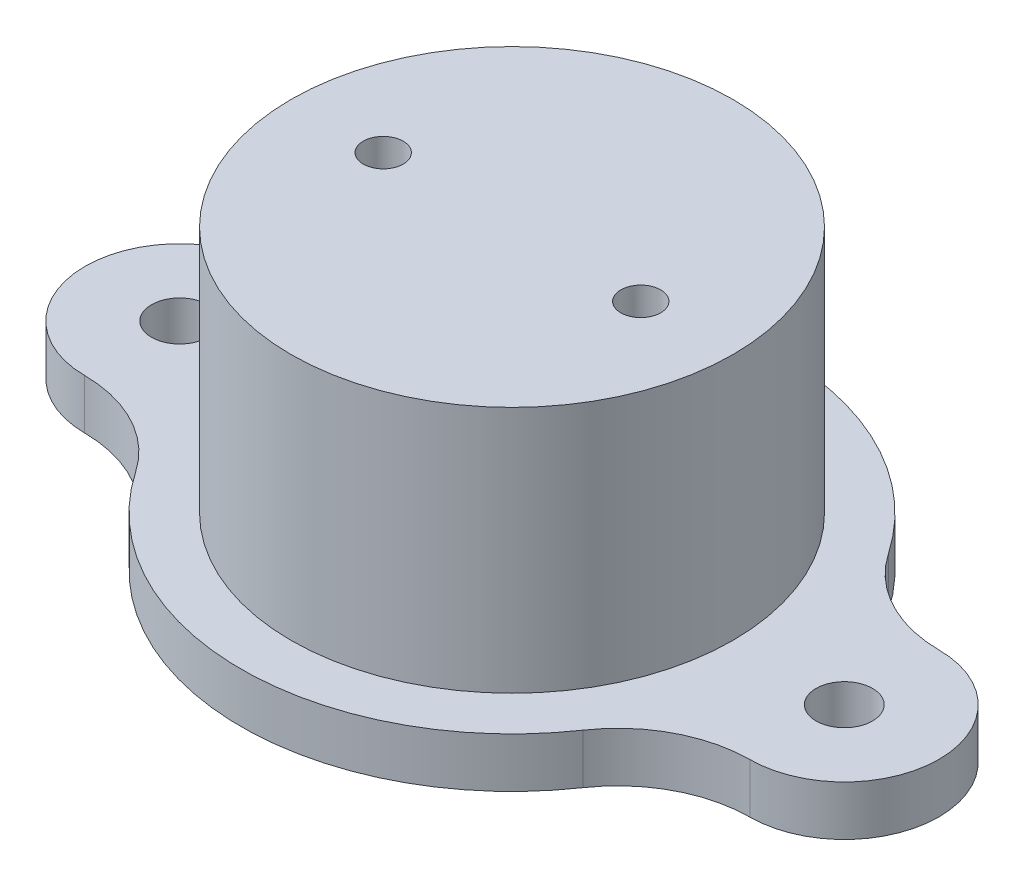
ISO-10303-21;
HEADER;
FILE_DESCRIPTION(('STEP AP214'),'2;1');
FILE_NAME('part.step','',(''),(''),'','','');
FILE_SCHEMA(('AUTOMOTIVE_DESIGN { 1 0 10303 214 1 1 1 1 }'));
ENDSEC;
DATA;
#1=APPLICATION_CONTEXT('core data for automotive mechanical design processes');
#2=APPLICATION_PROTOCOL_DEFINITION('international standard','automotive_design',2000,#1);
#3=PRODUCT_CONTEXT('',#1,'mechanical');
#4=PRODUCT('Part','Part','',(#3));
#5=PRODUCT_RELATED_PRODUCT_CATEGORY('part','',(#4));
#6=PRODUCT_DEFINITION_FORMATION('','',#4);
#7=PRODUCT_DEFINITION_CONTEXT('part definition',#1,'design');
#8=PRODUCT_DEFINITION('design','',#6,#7);
#9=PRODUCT_DEFINITION_SHAPE('','',#8);
#10=(LENGTH_UNIT() NAMED_UNIT(*) SI_UNIT(.MILLI.,.METRE.));
#11=(NAMED_UNIT(*) PLANE_ANGLE_UNIT() SI_UNIT($,.RADIAN.));
#12=(NAMED_UNIT(*) SI_UNIT($,.STERADIAN.) SOLID_ANGLE_UNIT());
#13=UNCERTAINTY_MEASURE_WITH_UNIT(LENGTH_MEASURE(1.E-05),#10,'distance_accuracy_value','');
#14=(GEOMETRIC_REPRESENTATION_CONTEXT(3) GLOBAL_UNCERTAINTY_ASSIGNED_CONTEXT((#13)) GLOBAL_UNIT_ASSIGNED_CONTEXT((#10,
#11,#12)) REPRESENTATION_CONTEXT('',''));
#15=CARTESIAN_POINT('',(0.,0.,0.));
#16=DIRECTION('',(0.,0.,1.));
#17=DIRECTION('',(1.,0.,0.));
#18=AXIS2_PLACEMENT_3D('',#15,#16,#17);
#19=CARTESIAN_POINT('',(0.,0.,0.));
#20=DIRECTION('',(0.,1.,0.));
#21=DIRECTION('',(-1.,0.,0.));
#22=AXIS2_PLACEMENT_3D('',#19,#20,#21);
#23=PLANE('',#22);
#24=CARTESIAN_POINT('',(-7.75,0.,0.));
#25=DIRECTION('',(0.,1.,0.));
#26=DIRECTION('',(0.,0.,1.));
#27=AXIS2_PLACEMENT_3D('',#24,#25,#26);
#28=CIRCLE('',#27,1.2);
#29=CARTESIAN_POINT('',(-7.75,0.,1.2));
#30=VERTEX_POINT('',#29);
#31=EDGE_CURVE('E246',#30,#30,#28,.F.);
#32=ORIENTED_EDGE('',*,*,#31,.F.);
#33=EDGE_LOOP('',(#32));
#34=FACE_BOUND('',#33,.T.);
#35=CARTESIAN_POINT('',(0.,0.,0.));
#36=DIRECTION('',(0.,-1.,0.));
#37=DIRECTION('',(1.,0.,0.));
#38=AXIS2_PLACEMENT_3D('',#35,#36,#37);
#39=CIRCLE('',#38,11.7);
#40=CARTESIAN_POINT('',(11.7,0.,0.));
#41=VERTEX_POINT('',#40);
#42=EDGE_CURVE('E11',#41,#41,#39,.T.);
#43=ORIENTED_EDGE('',*,*,#42,.T.);
#44=EDGE_LOOP('',(#43));
#45=FACE_BOUND('',#44,.T.);
#46=CARTESIAN_POINT('',(7.75,0.,0.));
#47=DIRECTION('',(0.,1.,0.));
#48=DIRECTION('',(0.,0.,1.));
#49=AXIS2_PLACEMENT_3D('',#46,#47,#48);
#50=CIRCLE('',#49,1.2);
#51=CARTESIAN_POINT('',(7.75,0.,1.2));
#52=VERTEX_POINT('',#51);
#53=EDGE_CURVE('E251',#52,#52,#50,.T.);
#54=ORIENTED_EDGE('',*,*,#53,.T.);
#55=EDGE_LOOP('',(#54));
#56=FACE_BOUND('',#55,.T.);
#57=ADVANCED_FACE('F34',(#34,#45,#56),#23,.F.);
#58=CARTESIAN_POINT('',(0.,2.99999999999998,0.));
#59=DIRECTION('',(0.,-1.,0.));
#60=DIRECTION('',(1.,0.,0.));
#61=AXIS2_PLACEMENT_3D('',#58,#59,#60);
#62=PLANE('',#61);
#63=CARTESIAN_POINT('',(-7.75,2.99999999999995,0.));
#64=DIRECTION('',(0.,-1.,0.));
#65=DIRECTION('',(1.,0.,0.));
#66=AXIS2_PLACEMENT_3D('',#63,#64,#65);
#67=CIRCLE('',#66,1.2);
#68=CARTESIAN_POINT('',(-6.55,2.99999999999995,0.));
#69=VERTEX_POINT('',#68);
#70=EDGE_CURVE('E257',#69,#69,#67,.F.);
#71=ORIENTED_EDGE('',*,*,#70,.F.);
#72=EDGE_LOOP('',(#71));
#73=FACE_BOUND('',#72,.T.);
#74=CARTESIAN_POINT('',(0.,2.99999999999995,0.));
#75=DIRECTION('',(0.,-1.,0.));
#76=DIRECTION('',(1.,0.,0.));
#77=AXIS2_PLACEMENT_3D('',#74,#75,#76);
#78=CIRCLE('',#77,13.3);
#79=CARTESIAN_POINT('',(13.3,2.99999999999999,0.));
#80=VERTEX_POINT('',#79);
#81=EDGE_CURVE('E168',#80,#80,#78,.T.);
#82=ORIENTED_EDGE('',*,*,#81,.F.);
#83=EDGE_LOOP('',(#82));
#84=FACE_BOUND('',#83,.T.);
#85=CARTESIAN_POINT('',(7.75,3.,0.));
#86=DIRECTION('',(0.,-1.,0.));
#87=DIRECTION('',(1.,0.,0.));
#88=AXIS2_PLACEMENT_3D('',#85,#86,#87);
#89=CIRCLE('',#88,1.2);
#90=CARTESIAN_POINT('',(8.95,3.00000000000001,0.));
#91=VERTEX_POINT('',#90);
#92=EDGE_CURVE('E253',#91,#91,#89,.T.);
#93=ORIENTED_EDGE('',*,*,#92,.T.);
#94=EDGE_LOOP('',(#93));
#95=FACE_BOUND('',#94,.T.);
#96=ADVANCED_FACE('F234',(#73,#84,#95),#62,.F.);
#97=CARTESIAN_POINT('',(9.50813650303509E-13,-272.323852837361,0.));
#98=DIRECTION('',(0.,-1.,0.));
#99=DIRECTION('',(1.,0.,0.));
#100=AXIS2_PLACEMENT_3D('',#97,#98,#99);
#101=CYLINDRICAL_SURFACE('',#100,16.3);
#102=DIRECTION('',(0.,1.,0.));
#103=VECTOR('',#102,1.);
#104=CARTESIAN_POINT('',(13.4625925925926,-14.9,-9.18959197602761));
#105=LINE('',#104,#103);
#106=CARTESIAN_POINT('',(13.4625925925926,-14.9,-9.18959197602759));
#107=VERTEX_POINT('',#106);
#108=CARTESIAN_POINT('',(13.4625925925926,-11.9,-9.1895919760276));
#109=VERTEX_POINT('',#108);
#110=EDGE_CURVE('E56',#107,#109,#105,.T.);
#111=ORIENTED_EDGE('',*,*,#110,.F.);
#112=CARTESIAN_POINT('',(0.,-14.9000000000001,0.));
#113=DIRECTION('',(0.,-1.,0.));
#114=DIRECTION('',(1.,0.,0.));
#115=AXIS2_PLACEMENT_3D('',#112,#113,#114);
#116=CIRCLE('',#115,16.3);
#117=CARTESIAN_POINT('',(-13.4625925925925,-14.9000000000001,-9.18959197602759));
#118=VERTEX_POINT('',#117);
#119=EDGE_CURVE('E188',#118,#107,#116,.T.);
#120=ORIENTED_EDGE('',*,*,#119,.F.);
#121=DIRECTION('',(0.,1.,0.));
#122=VECTOR('',#121,1.);
#123=CARTESIAN_POINT('',(-13.4625925925925,-14.9000000000001,-9.18959197602761));
#124=LINE('',#123,#122);
#125=CARTESIAN_POINT('',(-13.4625925925925,-11.9000000000001,-9.18959197602761));
#126=VERTEX_POINT('',#125);
#127=EDGE_CURVE('E171',#118,#126,#124,.T.);
#128=ORIENTED_EDGE('',*,*,#127,.T.);
#129=CARTESIAN_POINT('',(0.,-11.9000000000001,0.));
#130=DIRECTION('',(0.,-1.,0.));
#131=DIRECTION('',(1.,0.,0.));
#132=AXIS2_PLACEMENT_3D('',#129,#130,#131);
#133=CIRCLE('',#132,16.3);
#134=EDGE_CURVE('E182',#126,#109,#133,.T.);
#135=ORIENTED_EDGE('',*,*,#134,.T.);
#136=EDGE_LOOP('',(#111,#120,#128,#135));
#137=FACE_BOUND('',#136,.T.);
#138=ADVANCED_FACE('F223',(#137),#101,.T.);
#139=CARTESIAN_POINT('',(13.4625925925926,-14.9,9.18959197602759));
#140=VERTEX_POINT('',#139);
#141=CARTESIAN_POINT('',(-13.4625925925925,-14.9000000000001,9.18959197602759));
#142=VERTEX_POINT('',#141);
#143=EDGE_CURVE('E48',#140,#142,#116,.T.);
#144=ORIENTED_EDGE('',*,*,#143,.F.);
#145=DIRECTION('',(0.,1.,0.));
#146=VECTOR('',#145,1.);
#147=CARTESIAN_POINT('',(13.4625925925926,-14.9,9.18959197602761));
#148=LINE('',#147,#146);
#149=CARTESIAN_POINT('',(13.4625925925926,-11.9,9.18959197602761));
#150=VERTEX_POINT('',#149);
#151=EDGE_CURVE('E123',#140,#150,#148,.T.);
#152=ORIENTED_EDGE('',*,*,#151,.T.);
#153=CARTESIAN_POINT('',(-13.4625925925925,-11.9000000000001,9.1895919760276));
#154=VERTEX_POINT('',#153);
#155=EDGE_CURVE('E181',#150,#154,#133,.T.);
#156=ORIENTED_EDGE('',*,*,#155,.T.);
#157=DIRECTION('',(0.,1.,0.));
#158=VECTOR('',#157,1.);
#159=CARTESIAN_POINT('',(-13.4625925925925,-14.9000000000001,9.18959197602761));
#160=LINE('',#159,#158);
#161=EDGE_CURVE('E158',#142,#154,#160,.T.);
#162=ORIENTED_EDGE('',*,*,#161,.F.);
#163=EDGE_LOOP('',(#144,#152,#156,#162));
#164=FACE_BOUND('',#163,.T.);
#165=ADVANCED_FACE('F226',(#164),#101,.T.);
#166=CARTESIAN_POINT('',(9.50813650303509E-13,-272.323852837361,0.));
#167=DIRECTION('',(0.,-1.,0.));
#168=DIRECTION('',(1.,0.,0.));
#169=AXIS2_PLACEMENT_3D('',#166,#167,#168);
#170=CYLINDRICAL_SURFACE('',#169,11.7);
#171=ORIENTED_EDGE('',*,*,#42,.F.);
#172=EDGE_LOOP('',(#171));
#173=FACE_BOUND('',#172,.T.);
#174=CARTESIAN_POINT('',(0.,-16.0000000000001,0.));
#175=DIRECTION('',(0.,-1.,0.));
#176=DIRECTION('',(1.,0.,0.));
#177=AXIS2_PLACEMENT_3D('',#174,#175,#176);
#178=CIRCLE('',#177,11.6999999999999);
#179=CARTESIAN_POINT('',(11.7,-16.,0.));
#180=VERTEX_POINT('',#179);
#181=EDGE_CURVE('E41',#180,#180,#178,.T.);
#182=ORIENTED_EDGE('',*,*,#181,.T.);
#183=EDGE_LOOP('',(#182));
#184=FACE_BOUND('',#183,.T.);
#185=ADVANCED_FACE('F193',(#173,#184),#170,.F.);
#186=CARTESIAN_POINT('',(0.,-16.,0.));
#187=DIRECTION('',(0.,1.,0.));
#188=DIRECTION('',(-1.,0.,0.));
#189=AXIS2_PLACEMENT_3D('',#186,#187,#188);
#190=PLANE('',#189);
#191=ORIENTED_EDGE('',*,*,#181,.F.);
#192=EDGE_LOOP('',(#191));
#193=FACE_BOUND('',#192,.T.);
#194=CARTESIAN_POINT('',(0.,-16.0000000000001,0.));
#195=DIRECTION('',(0.,-1.,0.));
#196=DIRECTION('',(1.,0.,0.));
#197=AXIS2_PLACEMENT_3D('',#194,#195,#196);
#198=CIRCLE('',#197,13.2999999999999);
#199=CARTESIAN_POINT('',(13.3,-16.,0.));
#200=VERTEX_POINT('',#199);
#201=EDGE_CURVE('E187',#200,#200,#198,.T.);
#202=ORIENTED_EDGE('',*,*,#201,.T.);
#203=EDGE_LOOP('',(#202));
#204=FACE_BOUND('',#203,.T.);
#205=ADVANCED_FACE('F195',(#193,#204),#190,.F.);
#206=CARTESIAN_POINT('',(0.,-14.9000000000001,0.));
#207=DIRECTION('',(0.,1.,0.));
#208=DIRECTION('',(-1.,0.,0.));
#209=AXIS2_PLACEMENT_3D('',#206,#207,#208);
#210=CONICAL_SURFACE('',#209,16.3,1.21935153279135);
#211=ORIENTED_EDGE('',*,*,#201,.F.);
#212=EDGE_LOOP('',(#211));
#213=FACE_BOUND('',#212,.T.);
#214=EDGE_CURVE('E184',#142,#118,#116,.T.);
#215=ORIENTED_EDGE('',*,*,#214,.T.);
#216=ORIENTED_EDGE('',*,*,#119,.T.);
#217=CARTESIAN_POINT('',(0.,-14.9000000000001,0.));
#218=DIRECTION('',(0.,-1.,0.));
#219=DIRECTION('',(-1.,0.,0.));
#220=AXIS2_PLACEMENT_3D('',#217,#218,#219);
#221=CIRCLE('',#220,16.3);
#222=EDGE_CURVE('E110',#107,#140,#221,.T.);
#223=ORIENTED_EDGE('',*,*,#222,.T.);
#224=ORIENTED_EDGE('',*,*,#143,.T.);
#225=EDGE_LOOP('',(#215,#216,#223,#224));
#226=FACE_BOUND('',#225,.T.);
#227=ADVANCED_FACE('F198',(#213,#226),#210,.T.);
#228=CARTESIAN_POINT('',(0.,-11.9000000000001,0.));
#229=DIRECTION('',(0.,-1.,0.));
#230=DIRECTION('',(1.,0.,0.));
#231=AXIS2_PLACEMENT_3D('',#228,#229,#230);
#232=PLANE('',#231);
#233=ORIENTED_EDGE('',*,*,#134,.F.);
#234=CARTESIAN_POINT('',(-20.0699999999999,-11.9000000000001,-13.699821166716));
#235=DIRECTION('',(0.,-1.,0.));
#236=DIRECTION('',(-1.,0.,0.));
#237=AXIS2_PLACEMENT_3D('',#234,#235,#236);
#238=CIRCLE('',#237,8.);
#239=CARTESIAN_POINT('',(-20.0291240875912,-11.9000000000001,-5.69992559491104));
#240=VERTEX_POINT('',#239);
#241=EDGE_CURVE('E161',#126,#240,#238,.T.);
#242=ORIENTED_EDGE('',*,*,#241,.T.);
#243=CARTESIAN_POINT('',(-20.,-11.9000000000001,0.));
#244=DIRECTION('',(0.,1.,0.));
#245=DIRECTION('',(-1.,0.,0.));
#246=AXIS2_PLACEMENT_3D('',#243,#244,#245);
#247=CIRCLE('',#246,5.7);
#248=CARTESIAN_POINT('',(-20.0291240875912,-11.9000000000001,5.69992559491104));
#249=VERTEX_POINT('',#248);
#250=EDGE_CURVE('E152',#240,#249,#247,.T.);
#251=ORIENTED_EDGE('',*,*,#250,.T.);
#252=CARTESIAN_POINT('',(-20.0699999999999,-11.9000000000001,13.699821166716));
#253=DIRECTION('',(0.,-1.,0.));
#254=DIRECTION('',(-1.,0.,0.));
#255=AXIS2_PLACEMENT_3D('',#252,#253,#254);
#256=CIRCLE('',#255,8.);
#257=EDGE_CURVE('E145',#249,#154,#256,.T.);
#258=ORIENTED_EDGE('',*,*,#257,.T.);
#259=ORIENTED_EDGE('',*,*,#155,.F.);
#260=CARTESIAN_POINT('',(20.07,-11.9,13.699821166716));
#261=DIRECTION('',(0.,-1.,0.));
#262=DIRECTION('',(1.,0.,0.));
#263=AXIS2_PLACEMENT_3D('',#260,#261,#262);
#264=CIRCLE('',#263,8.);
#265=CARTESIAN_POINT('',(20.0291240875913,-11.9,5.69992559491104));
#266=VERTEX_POINT('',#265);
#267=EDGE_CURVE('E134',#150,#266,#264,.T.);
#268=ORIENTED_EDGE('',*,*,#267,.T.);
#269=CARTESIAN_POINT('',(20.,-11.9,0.));
#270=DIRECTION('',(0.,1.,0.));
#271=DIRECTION('',(1.,0.,0.));
#272=AXIS2_PLACEMENT_3D('',#269,#270,#271);
#273=CIRCLE('',#272,5.7);
#274=CARTESIAN_POINT('',(20.0291240875913,-11.9,-5.69992559491104));
#275=VERTEX_POINT('',#274);
#276=EDGE_CURVE('E104',#266,#275,#273,.T.);
#277=ORIENTED_EDGE('',*,*,#276,.T.);
#278=CARTESIAN_POINT('',(20.07,-11.9,-13.699821166716));
#279=DIRECTION('',(0.,-1.,0.));
#280=DIRECTION('',(1.,0.,0.));
#281=AXIS2_PLACEMENT_3D('',#278,#279,#280);
#282=CIRCLE('',#281,8.);
#283=EDGE_CURVE('E124',#275,#109,#282,.T.);
#284=ORIENTED_EDGE('',*,*,#283,.T.);
#285=EDGE_LOOP('',(#233,#242,#251,#258,#259,#268,#277,#284));
#286=FACE_BOUND('',#285,.T.);
#287=CARTESIAN_POINT('',(0.,-11.9000000000001,0.));
#288=DIRECTION('',(0.,-1.,0.));
#289=DIRECTION('',(1.,0.,0.));
#290=AXIS2_PLACEMENT_3D('',#287,#288,#289);
#291=CIRCLE('',#290,13.3);
#292=CARTESIAN_POINT('',(13.3,-11.9,0.));
#293=VERTEX_POINT('',#292);
#294=EDGE_CURVE('E178',#293,#293,#291,.T.);
#295=ORIENTED_EDGE('',*,*,#294,.T.);
#296=EDGE_LOOP('',(#295));
#297=FACE_BOUND('',#296,.T.);
#298=CARTESIAN_POINT('',(-20.,-11.9000000000001,0.));
#299=DIRECTION('',(0.,1.,0.));
#300=DIRECTION('',(-1.,0.,0.));
#301=AXIS2_PLACEMENT_3D('',#298,#299,#300);
#302=CIRCLE('',#301,1.7);
#303=CARTESIAN_POINT('',(-21.7,-11.9000000000001,0.));
#304=VERTEX_POINT('',#303);
#305=EDGE_CURVE('E139',#304,#304,#302,.T.);
#306=ORIENTED_EDGE('',*,*,#305,.F.);
#307=EDGE_LOOP('',(#306));
#308=FACE_BOUND('',#307,.T.);
#309=CARTESIAN_POINT('',(20.,-11.9,0.));
#310=DIRECTION('',(0.,1.,0.));
#311=DIRECTION('',(-1.,0.,0.));
#312=AXIS2_PLACEMENT_3D('',#309,#310,#311);
#313=CIRCLE('',#312,1.7);
#314=CARTESIAN_POINT('',(18.3,-11.9,0.));
#315=VERTEX_POINT('',#314);
#316=EDGE_CURVE('E129',#315,#315,#313,.T.);
#317=ORIENTED_EDGE('',*,*,#316,.F.);
#318=EDGE_LOOP('',(#317));
#319=FACE_BOUND('',#318,.T.);
#320=ADVANCED_FACE('F204',(#286,#297,#308,#319),#232,.F.);
#321=CARTESIAN_POINT('',(9.50813650303509E-13,-272.323852837361,0.));
#322=DIRECTION('',(0.,-1.,0.));
#323=DIRECTION('',(1.,0.,0.));
#324=AXIS2_PLACEMENT_3D('',#321,#322,#323);
#325=CYLINDRICAL_SURFACE('',#324,13.3);
#326=ORIENTED_EDGE('',*,*,#294,.F.);
#327=EDGE_LOOP('',(#326));
#328=FACE_BOUND('',#327,.T.);
#329=ORIENTED_EDGE('',*,*,#81,.T.);
#330=EDGE_LOOP('',(#329));
#331=FACE_BOUND('',#330,.T.);
#332=ADVANCED_FACE('F274',(#328,#331),#325,.T.);
#333=CARTESIAN_POINT('',(-20.0699999999999,-14.9000000000001,13.699821166716));
#334=DIRECTION('',(0.,1.,0.));
#335=DIRECTION('',(-1.,0.,0.));
#336=AXIS2_PLACEMENT_3D('',#333,#334,#335);
#337=CYLINDRICAL_SURFACE('',#336,8.);
#338=ORIENTED_EDGE('',*,*,#257,.F.);
#339=DIRECTION('',(0.,1.,0.));
#340=VECTOR('',#339,1.);
#341=CARTESIAN_POINT('',(-20.0291240875912,-14.9000000000001,5.69992559491104));
#342=LINE('',#341,#340);
#343=CARTESIAN_POINT('',(-20.0291240875912,-14.9000000000001,5.69992559491104));
#344=VERTEX_POINT('',#343);
#345=EDGE_CURVE('E166',#344,#249,#342,.T.);
#346=ORIENTED_EDGE('',*,*,#345,.F.);
#347=CARTESIAN_POINT('',(-20.0699999999999,-14.9000000000001,13.699821166716));
#348=DIRECTION('',(0.,-1.,0.));
#349=DIRECTION('',(-1.,0.,0.));
#350=AXIS2_PLACEMENT_3D('',#347,#348,#349);
#351=CIRCLE('',#350,8.);
#352=EDGE_CURVE('E148',#344,#142,#351,.T.);
#353=ORIENTED_EDGE('',*,*,#352,.T.);
#354=ORIENTED_EDGE('',*,*,#161,.T.);
#355=EDGE_LOOP('',(#338,#346,#353,#354));
#356=FACE_BOUND('',#355,.T.);
#357=ADVANCED_FACE('F278',(#356),#337,.F.);
#358=CARTESIAN_POINT('',(-19.9999999999999,-14.9000000000001,0.));
#359=DIRECTION('',(0.,1.,0.));
#360=DIRECTION('',(-1.,0.,0.));
#361=AXIS2_PLACEMENT_3D('',#358,#359,#360);
#362=CYLINDRICAL_SURFACE('',#361,5.7);
#363=ORIENTED_EDGE('',*,*,#250,.F.);
#364=DIRECTION('',(0.,1.,0.));
#365=VECTOR('',#364,1.);
#366=CARTESIAN_POINT('',(-20.0291240875912,-14.9000000000001,-5.69992559491104));
#367=LINE('',#366,#365);
#368=CARTESIAN_POINT('',(-20.0291240875912,-14.9000000000001,-5.69992559491104));
#369=VERTEX_POINT('',#368);
#370=EDGE_CURVE('E169',#369,#240,#367,.T.);
#371=ORIENTED_EDGE('',*,*,#370,.F.);
#372=CARTESIAN_POINT('',(-19.9999999999999,-14.9000000000001,0.));
#373=DIRECTION('',(0.,1.,0.));
#374=DIRECTION('',(-1.,0.,0.));
#375=AXIS2_PLACEMENT_3D('',#372,#373,#374);
#376=CIRCLE('',#375,5.7);
#377=EDGE_CURVE('E155',#369,#344,#376,.T.);
#378=ORIENTED_EDGE('',*,*,#377,.T.);
#379=ORIENTED_EDGE('',*,*,#345,.T.);
#380=EDGE_LOOP('',(#363,#371,#378,#379));
#381=FACE_BOUND('',#380,.T.);
#382=ADVANCED_FACE('F218',(#381),#362,.T.);
#383=CARTESIAN_POINT('',(-20.0699999999999,-14.9000000000001,-13.699821166716));
#384=DIRECTION('',(0.,1.,0.));
#385=DIRECTION('',(-1.,0.,0.));
#386=AXIS2_PLACEMENT_3D('',#383,#384,#385);
#387=CYLINDRICAL_SURFACE('',#386,8.);
#388=ORIENTED_EDGE('',*,*,#241,.F.);
#389=ORIENTED_EDGE('',*,*,#127,.F.);
#390=CARTESIAN_POINT('',(-20.0699999999999,-14.9000000000001,-13.699821166716));
#391=DIRECTION('',(0.,-1.,0.));
#392=DIRECTION('',(-1.,0.,0.));
#393=AXIS2_PLACEMENT_3D('',#390,#391,#392);
#394=CIRCLE('',#393,8.);
#395=EDGE_CURVE('E151',#118,#369,#394,.T.);
#396=ORIENTED_EDGE('',*,*,#395,.T.);
#397=ORIENTED_EDGE('',*,*,#370,.T.);
#398=EDGE_LOOP('',(#388,#389,#396,#397));
#399=FACE_BOUND('',#398,.T.);
#400=ADVANCED_FACE('F213',(#399),#387,.F.);
#401=CARTESIAN_POINT('',(-20.0349999999999,-14.9000000000001,6.84991058335801));
#402=DIRECTION('',(0.,1.,0.));
#403=DIRECTION('',(-1.,0.,0.));
#404=AXIS2_PLACEMENT_3D('',#401,#402,#403);
#405=PLANE('',#404);
#406=CARTESIAN_POINT('',(-19.9999999999999,-14.9000000000001,0.));
#407=DIRECTION('',(0.,1.,0.));
#408=DIRECTION('',(-1.,0.,0.));
#409=AXIS2_PLACEMENT_3D('',#406,#407,#408);
#410=CIRCLE('',#409,1.7);
#411=CARTESIAN_POINT('',(-21.6999999999999,-14.9000000000001,0.));
#412=VERTEX_POINT('',#411);
#413=EDGE_CURVE('E142',#412,#412,#410,.T.);
#414=ORIENTED_EDGE('',*,*,#413,.T.);
#415=EDGE_LOOP('',(#414));
#416=FACE_BOUND('',#415,.T.);
#417=ORIENTED_EDGE('',*,*,#352,.F.);
#418=ORIENTED_EDGE('',*,*,#377,.F.);
#419=ORIENTED_EDGE('',*,*,#395,.F.);
#420=ORIENTED_EDGE('',*,*,#214,.F.);
#421=EDGE_LOOP('',(#417,#418,#419,#420));
#422=FACE_BOUND('',#421,.T.);
#423=ADVANCED_FACE('F215',(#416,#422),#405,.F.);
#424=CARTESIAN_POINT('',(-19.9999999999999,-14.9000000000001,0.));
#425=DIRECTION('',(0.,1.,0.));
#426=DIRECTION('',(-1.,0.,0.));
#427=AXIS2_PLACEMENT_3D('',#424,#425,#426);
#428=CYLINDRICAL_SURFACE('',#427,1.7);
#429=ORIENTED_EDGE('',*,*,#413,.F.);
#430=EDGE_LOOP('',(#429));
#431=FACE_BOUND('',#430,.T.);
#432=ORIENTED_EDGE('',*,*,#305,.T.);
#433=EDGE_LOOP('',(#432));
#434=FACE_BOUND('',#433,.T.);
#435=ADVANCED_FACE('F291',(#431,#434),#428,.F.);
#436=CARTESIAN_POINT('',(20.07,-14.9,13.699821166716));
#437=DIRECTION('',(0.,1.,0.));
#438=DIRECTION('',(-1.,0.,0.));
#439=AXIS2_PLACEMENT_3D('',#436,#437,#438);
#440=CYLINDRICAL_SURFACE('',#439,8.);
#441=ORIENTED_EDGE('',*,*,#267,.F.);
#442=ORIENTED_EDGE('',*,*,#151,.F.);
#443=CARTESIAN_POINT('',(20.07,-14.9,13.699821166716));
#444=DIRECTION('',(0.,-1.,0.));
#445=DIRECTION('',(1.,0.,0.));
#446=AXIS2_PLACEMENT_3D('',#443,#444,#445);
#447=CIRCLE('',#446,8.);
#448=CARTESIAN_POINT('',(20.0291240875913,-14.9,5.69992559491104));
#449=VERTEX_POINT('',#448);
#450=EDGE_CURVE('E117',#140,#449,#447,.T.);
#451=ORIENTED_EDGE('',*,*,#450,.T.);
#452=DIRECTION('',(0.,1.,0.));
#453=VECTOR('',#452,1.);
#454=CARTESIAN_POINT('',(20.0291240875913,-14.9,5.69992559491104));
#455=LINE('',#454,#453);
#456=EDGE_CURVE('E99',#449,#266,#455,.T.);
#457=ORIENTED_EDGE('',*,*,#456,.T.);
#458=EDGE_LOOP('',(#441,#442,#451,#457));
#459=FACE_BOUND('',#458,.T.);
#460=ADVANCED_FACE('F122',(#459),#440,.F.);
#461=CARTESIAN_POINT('',(20.07,-14.9,-13.699821166716));
#462=DIRECTION('',(0.,1.,0.));
#463=DIRECTION('',(-1.,0.,0.));
#464=AXIS2_PLACEMENT_3D('',#461,#462,#463);
#465=CYLINDRICAL_SURFACE('',#464,8.);
#466=ORIENTED_EDGE('',*,*,#283,.F.);
#467=DIRECTION('',(0.,1.,0.));
#468=VECTOR('',#467,1.);
#469=CARTESIAN_POINT('',(20.0291240875913,-14.9,-5.69992559491104));
#470=LINE('',#469,#468);
#471=CARTESIAN_POINT('',(20.0291240875913,-14.9,-5.69992559491104));
#472=VERTEX_POINT('',#471);
#473=EDGE_CURVE('E109',#472,#275,#470,.T.);
#474=ORIENTED_EDGE('',*,*,#473,.F.);
#475=CARTESIAN_POINT('',(20.07,-14.9,-13.699821166716));
#476=DIRECTION('',(0.,-1.,0.));
#477=DIRECTION('',(1.,0.,0.));
#478=AXIS2_PLACEMENT_3D('',#475,#476,#477);
#479=CIRCLE('',#478,8.);
#480=EDGE_CURVE('E119',#472,#107,#479,.T.);
#481=ORIENTED_EDGE('',*,*,#480,.T.);
#482=ORIENTED_EDGE('',*,*,#110,.T.);
#483=EDGE_LOOP('',(#466,#474,#481,#482));
#484=FACE_BOUND('',#483,.T.);
#485=ADVANCED_FACE('F225',(#484),#465,.F.);
#486=CARTESIAN_POINT('',(20.0000000000001,-14.9,0.));
#487=DIRECTION('',(0.,1.,0.));
#488=DIRECTION('',(-1.,0.,0.));
#489=AXIS2_PLACEMENT_3D('',#486,#487,#488);
#490=CYLINDRICAL_SURFACE('',#489,5.7);
#491=ORIENTED_EDGE('',*,*,#276,.F.);
#492=ORIENTED_EDGE('',*,*,#456,.F.);
#493=CARTESIAN_POINT('',(20.0000000000001,-14.9,0.));
#494=DIRECTION('',(0.,1.,0.));
#495=DIRECTION('',(1.,0.,0.));
#496=AXIS2_PLACEMENT_3D('',#493,#494,#495);
#497=CIRCLE('',#496,5.7);
#498=EDGE_CURVE('E102',#449,#472,#497,.T.);
#499=ORIENTED_EDGE('',*,*,#498,.T.);
#500=ORIENTED_EDGE('',*,*,#473,.T.);
#501=EDGE_LOOP('',(#491,#492,#499,#500));
#502=FACE_BOUND('',#501,.T.);
#503=ADVANCED_FACE('F101',(#502),#490,.T.);
#504=CARTESIAN_POINT('',(20.035,-14.9,6.84991058335801));
#505=DIRECTION('',(0.,-1.,0.));
#506=DIRECTION('',(1.,0.,0.));
#507=AXIS2_PLACEMENT_3D('',#504,#505,#506);
#508=PLANE('',#507);
#509=CARTESIAN_POINT('',(20.0000000000001,-14.9,0.));
#510=DIRECTION('',(0.,1.,0.));
#511=DIRECTION('',(-1.,0.,0.));
#512=AXIS2_PLACEMENT_3D('',#509,#510,#511);
#513=CIRCLE('',#512,1.7);
#514=CARTESIAN_POINT('',(18.3000000000001,-14.9,0.));
#515=VERTEX_POINT('',#514);
#516=EDGE_CURVE('E136',#515,#515,#513,.T.);
#517=ORIENTED_EDGE('',*,*,#516,.T.);
#518=EDGE_LOOP('',(#517));
#519=FACE_BOUND('',#518,.T.);
#520=ORIENTED_EDGE('',*,*,#450,.F.);
#521=ORIENTED_EDGE('',*,*,#222,.F.);
#522=ORIENTED_EDGE('',*,*,#480,.F.);
#523=ORIENTED_EDGE('',*,*,#498,.F.);
#524=EDGE_LOOP('',(#520,#521,#522,#523));
#525=FACE_BOUND('',#524,.T.);
#526=ADVANCED_FACE('F115',(#519,#525),#508,.T.);
#527=CARTESIAN_POINT('',(20.0000000000001,-14.9,0.));
#528=DIRECTION('',(0.,1.,0.));
#529=DIRECTION('',(-1.,0.,0.));
#530=AXIS2_PLACEMENT_3D('',#527,#528,#529);
#531=CYLINDRICAL_SURFACE('',#530,1.7);
#532=ORIENTED_EDGE('',*,*,#516,.F.);
#533=EDGE_LOOP('',(#532));
#534=FACE_BOUND('',#533,.T.);
#535=ORIENTED_EDGE('',*,*,#316,.T.);
#536=EDGE_LOOP('',(#535));
#537=FACE_BOUND('',#536,.T.);
#538=ADVANCED_FACE('F266',(#534,#537),#531,.F.);
#539=CARTESIAN_POINT('',(-7.75,3.00099999999999,0.));
#540=DIRECTION('',(0.,-1.,0.));
#541=DIRECTION('',(0.,0.,-1.));
#542=AXIS2_PLACEMENT_3D('',#539,#540,#541);
#543=CYLINDRICAL_SURFACE('',#542,1.2);
#544=ORIENTED_EDGE('',*,*,#31,.T.);
#545=EDGE_LOOP('',(#544));
#546=FACE_BOUND('',#545,.T.);
#547=ORIENTED_EDGE('',*,*,#70,.T.);
#548=EDGE_LOOP('',(#547));
#549=FACE_BOUND('',#548,.T.);
#550=ADVANCED_FACE('F269',(#546,#549),#543,.F.);
#551=CARTESIAN_POINT('',(7.75,3.00099999999999,0.));
#552=DIRECTION('',(0.,-1.,0.));
#553=DIRECTION('',(0.,0.,-1.));
#554=AXIS2_PLACEMENT_3D('',#551,#552,#553);
#555=CYLINDRICAL_SURFACE('',#554,1.2);
#556=ORIENTED_EDGE('',*,*,#53,.F.);
#557=EDGE_LOOP('',(#556));
#558=FACE_BOUND('',#557,.T.);
#559=ORIENTED_EDGE('',*,*,#92,.F.);
#560=EDGE_LOOP('',(#559));
#561=FACE_BOUND('',#560,.T.);
#562=ADVANCED_FACE('F306',(#558,#561),#555,.F.);
#563=CLOSED_SHELL('',(#57,#96,#138,#165,#185,#205,#227,#320,#332,#357,#382,#400,#423,#435,#460,
#485,#503,#526,#538,#550,#562));
#564=MANIFOLD_SOLID_BREP('B2',#563);
#565=ADVANCED_BREP_SHAPE_REPRESENTATION('',(#18,#564),#14);
#566=SHAPE_DEFINITION_REPRESENTATION(#9,#565);
ENDSEC;
END-ISO-10303-21;
